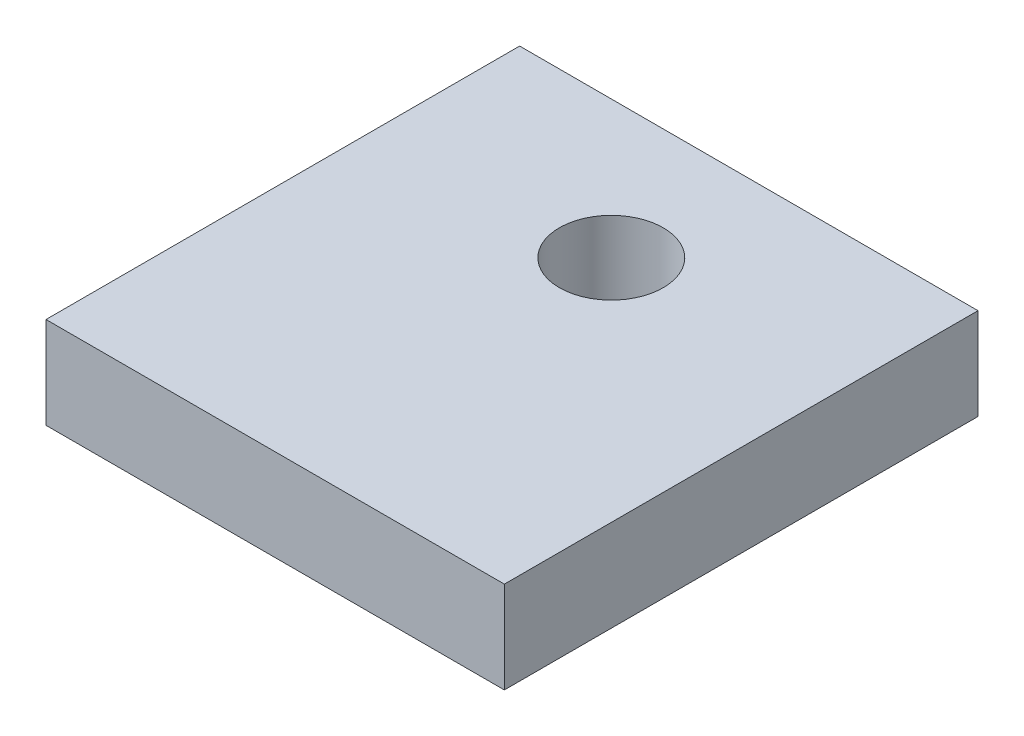
ISO-10303-21;
HEADER;
FILE_DESCRIPTION(('STEP AP214'),'2;1');
FILE_NAME('part.step','',(''),(''),'','','');
FILE_SCHEMA(('AUTOMOTIVE_DESIGN { 1 0 10303 214 1 1 1 1 }'));
ENDSEC;
DATA;
#1=APPLICATION_CONTEXT('core data for automotive mechanical design processes');
#2=APPLICATION_PROTOCOL_DEFINITION('international standard','automotive_design',2000,#1);
#3=PRODUCT_CONTEXT('',#1,'mechanical');
#4=PRODUCT('Part','Part','',(#3));
#5=PRODUCT_RELATED_PRODUCT_CATEGORY('part','',(#4));
#6=PRODUCT_DEFINITION_FORMATION('','',#4);
#7=PRODUCT_DEFINITION_CONTEXT('part definition',#1,'design');
#8=PRODUCT_DEFINITION('design','',#6,#7);
#9=PRODUCT_DEFINITION_SHAPE('','',#8);
#10=(LENGTH_UNIT() NAMED_UNIT(*) SI_UNIT(.MILLI.,.METRE.));
#11=(NAMED_UNIT(*) PLANE_ANGLE_UNIT() SI_UNIT($,.RADIAN.));
#12=(NAMED_UNIT(*) SI_UNIT($,.STERADIAN.) SOLID_ANGLE_UNIT());
#13=UNCERTAINTY_MEASURE_WITH_UNIT(LENGTH_MEASURE(1.E-05),#10,'distance_accuracy_value','');
#14=(GEOMETRIC_REPRESENTATION_CONTEXT(3) GLOBAL_UNCERTAINTY_ASSIGNED_CONTEXT((#13)) GLOBAL_UNIT_ASSIGNED_CONTEXT((#10,
#11,#12)) REPRESENTATION_CONTEXT('',''));
#15=CARTESIAN_POINT('',(0.,0.,0.));
#16=DIRECTION('',(0.,0.,1.));
#17=DIRECTION('',(1.,0.,0.));
#18=AXIS2_PLACEMENT_3D('',#15,#16,#17);
#19=CARTESIAN_POINT('',(0.,6.,0.));
#20=DIRECTION('',(0.,1.,0.));
#21=DIRECTION('',(0.,0.,1.));
#22=AXIS2_PLACEMENT_3D('',#19,#20,#21);
#23=PLANE('',#22);
#24=CARTESIAN_POINT('',(0.,6.,-6.5));
#25=DIRECTION('',(0.,1.,0.));
#26=DIRECTION('',(0.,0.,1.));
#27=AXIS2_PLACEMENT_3D('',#24,#25,#26);
#28=CIRCLE('',#27,3.4);
#29=CARTESIAN_POINT('',(0.,6.,-3.1));
#30=VERTEX_POINT('',#29);
#31=EDGE_CURVE('E20',#30,#30,#28,.F.);
#32=ORIENTED_EDGE('',*,*,#31,.T.);
#33=EDGE_LOOP('',(#32));
#34=FACE_BOUND('',#33,.T.);
#35=DIRECTION('',(-1.,0.,0.));
#36=VECTOR('',#35,1.);
#37=CARTESIAN_POINT('',(15.,6.,-15.5));
#38=LINE('',#37,#36);
#39=CARTESIAN_POINT('',(-15.,6.,-15.5));
#40=VERTEX_POINT('',#39);
#41=CARTESIAN_POINT('',(15.,6.,-15.5));
#42=VERTEX_POINT('',#41);
#43=EDGE_CURVE('E70',#40,#42,#38,.F.);
#44=ORIENTED_EDGE('',*,*,#43,.F.);
#45=DIRECTION('',(0.,0.,1.));
#46=VECTOR('',#45,1.);
#47=CARTESIAN_POINT('',(-15.,6.,-15.5));
#48=LINE('',#47,#46);
#49=CARTESIAN_POINT('',(-15.,6.,15.5));
#50=VERTEX_POINT('',#49);
#51=EDGE_CURVE('E67',#50,#40,#48,.F.);
#52=ORIENTED_EDGE('',*,*,#51,.F.);
#53=DIRECTION('',(1.,0.,0.));
#54=VECTOR('',#53,1.);
#55=CARTESIAN_POINT('',(-15.,6.,15.5));
#56=LINE('',#55,#54);
#57=CARTESIAN_POINT('',(15.,6.,15.5));
#58=VERTEX_POINT('',#57);
#59=EDGE_CURVE('E58',#58,#50,#56,.F.);
#60=ORIENTED_EDGE('',*,*,#59,.F.);
#61=DIRECTION('',(0.,0.,-1.));
#62=VECTOR('',#61,1.);
#63=CARTESIAN_POINT('',(15.,6.,15.5));
#64=LINE('',#63,#62);
#65=EDGE_CURVE('E53',#42,#58,#64,.F.);
#66=ORIENTED_EDGE('',*,*,#65,.F.);
#67=EDGE_LOOP('',(#44,#52,#60,#66));
#68=FACE_BOUND('',#67,.T.);
#69=ADVANCED_FACE('F17',(#34,#68),#23,.T.);
#70=CARTESIAN_POINT('',(-15.,0.,-15.5));
#71=DIRECTION('',(-1.,0.,0.));
#72=DIRECTION('',(0.,0.,1.));
#73=AXIS2_PLACEMENT_3D('',#70,#71,#72);
#74=PLANE('',#73);
#75=DIRECTION('',(0.,1.,0.));
#76=VECTOR('',#75,1.);
#77=CARTESIAN_POINT('',(-15.,0.,-15.5));
#78=LINE('',#77,#76);
#79=CARTESIAN_POINT('',(-15.,0.,-15.5));
#80=VERTEX_POINT('',#79);
#81=EDGE_CURVE('E82',#80,#40,#78,.T.);
#82=ORIENTED_EDGE('',*,*,#81,.F.);
#83=DIRECTION('',(0.,0.,1.));
#84=VECTOR('',#83,1.);
#85=CARTESIAN_POINT('',(-15.,0.,0.));
#86=LINE('',#85,#84);
#87=CARTESIAN_POINT('',(-15.,0.,15.5));
#88=VERTEX_POINT('',#87);
#89=EDGE_CURVE('E77',#80,#88,#86,.T.);
#90=ORIENTED_EDGE('',*,*,#89,.T.);
#91=DIRECTION('',(0.,1.,0.));
#92=VECTOR('',#91,1.);
#93=CARTESIAN_POINT('',(-15.,0.,15.5));
#94=LINE('',#93,#92);
#95=EDGE_CURVE('E63',#50,#88,#94,.F.);
#96=ORIENTED_EDGE('',*,*,#95,.F.);
#97=ORIENTED_EDGE('',*,*,#51,.T.);
#98=EDGE_LOOP('',(#82,#90,#96,#97));
#99=FACE_BOUND('',#98,.T.);
#100=ADVANCED_FACE('F76',(#99),#74,.T.);
#101=CARTESIAN_POINT('',(-15.,0.,15.5));
#102=DIRECTION('',(0.,0.,1.));
#103=DIRECTION('',(1.,0.,0.));
#104=AXIS2_PLACEMENT_3D('',#101,#102,#103);
#105=PLANE('',#104);
#106=ORIENTED_EDGE('',*,*,#95,.T.);
#107=DIRECTION('',(1.,0.,0.));
#108=VECTOR('',#107,1.);
#109=CARTESIAN_POINT('',(0.,0.,15.5));
#110=LINE('',#109,#108);
#111=CARTESIAN_POINT('',(15.,0.,15.5));
#112=VERTEX_POINT('',#111);
#113=EDGE_CURVE('E87',#88,#112,#110,.T.);
#114=ORIENTED_EDGE('',*,*,#113,.T.);
#115=DIRECTION('',(0.,1.,0.));
#116=VECTOR('',#115,1.);
#117=CARTESIAN_POINT('',(15.,0.,15.5));
#118=LINE('',#117,#116);
#119=EDGE_CURVE('E65',#58,#112,#118,.F.);
#120=ORIENTED_EDGE('',*,*,#119,.F.);
#121=ORIENTED_EDGE('',*,*,#59,.T.);
#122=EDGE_LOOP('',(#106,#114,#120,#121));
#123=FACE_BOUND('',#122,.T.);
#124=ADVANCED_FACE('F60',(#123),#105,.T.);
#125=CARTESIAN_POINT('',(15.,0.,15.5));
#126=DIRECTION('',(1.,0.,0.));
#127=DIRECTION('',(0.,0.,-1.));
#128=AXIS2_PLACEMENT_3D('',#125,#126,#127);
#129=PLANE('',#128);
#130=ORIENTED_EDGE('',*,*,#119,.T.);
#131=DIRECTION('',(0.,0.,1.));
#132=VECTOR('',#131,1.);
#133=CARTESIAN_POINT('',(15.,0.,0.));
#134=LINE('',#133,#132);
#135=CARTESIAN_POINT('',(15.,0.,-15.5));
#136=VERTEX_POINT('',#135);
#137=EDGE_CURVE('E89',#112,#136,#134,.F.);
#138=ORIENTED_EDGE('',*,*,#137,.T.);
#139=DIRECTION('',(0.,1.,0.));
#140=VECTOR('',#139,1.);
#141=CARTESIAN_POINT('',(15.,0.,-15.5));
#142=LINE('',#141,#140);
#143=EDGE_CURVE('E34',#42,#136,#142,.F.);
#144=ORIENTED_EDGE('',*,*,#143,.F.);
#145=ORIENTED_EDGE('',*,*,#65,.T.);
#146=EDGE_LOOP('',(#130,#138,#144,#145));
#147=FACE_BOUND('',#146,.T.);
#148=ADVANCED_FACE('F96',(#147),#129,.T.);
#149=CARTESIAN_POINT('',(15.,0.,-15.5));
#150=DIRECTION('',(0.,0.,-1.));
#151=DIRECTION('',(-1.,0.,0.));
#152=AXIS2_PLACEMENT_3D('',#149,#150,#151);
#153=PLANE('',#152);
#154=ORIENTED_EDGE('',*,*,#143,.T.);
#155=DIRECTION('',(1.,0.,0.));
#156=VECTOR('',#155,1.);
#157=CARTESIAN_POINT('',(0.,0.,-15.5));
#158=LINE('',#157,#156);
#159=EDGE_CURVE('E26',#136,#80,#158,.F.);
#160=ORIENTED_EDGE('',*,*,#159,.T.);
#161=ORIENTED_EDGE('',*,*,#81,.T.);
#162=ORIENTED_EDGE('',*,*,#43,.T.);
#163=EDGE_LOOP('',(#154,#160,#161,#162));
#164=FACE_BOUND('',#163,.T.);
#165=ADVANCED_FACE('F92',(#164),#153,.T.);
#166=CARTESIAN_POINT('',(0.,-3.49507240993,-6.5));
#167=DIRECTION('',(0.,1.,0.));
#168=DIRECTION('',(0.,0.,1.));
#169=AXIS2_PLACEMENT_3D('',#166,#167,#168);
#170=CYLINDRICAL_SURFACE('',#169,3.4);
#171=ORIENTED_EDGE('',*,*,#31,.F.);
#172=EDGE_LOOP('',(#171));
#173=FACE_BOUND('',#172,.T.);
#174=CARTESIAN_POINT('',(0.,0.,-6.5));
#175=DIRECTION('',(0.,1.,0.));
#176=DIRECTION('',(0.,0.,1.));
#177=AXIS2_PLACEMENT_3D('',#174,#175,#176);
#178=CIRCLE('',#177,3.4);
#179=CARTESIAN_POINT('',(0.,0.,-3.1));
#180=VERTEX_POINT('',#179);
#181=EDGE_CURVE('E11',#180,#180,#178,.F.);
#182=ORIENTED_EDGE('',*,*,#181,.T.);
#183=EDGE_LOOP('',(#182));
#184=FACE_BOUND('',#183,.T.);
#185=ADVANCED_FACE('F104',(#173,#184),#170,.F.);
#186=CARTESIAN_POINT('',(0.,0.,0.));
#187=DIRECTION('',(0.,1.,0.));
#188=DIRECTION('',(0.,0.,1.));
#189=AXIS2_PLACEMENT_3D('',#186,#187,#188);
#190=PLANE('',#189);
#191=ORIENTED_EDGE('',*,*,#181,.F.);
#192=EDGE_LOOP('',(#191));
#193=FACE_BOUND('',#192,.T.);
#194=ORIENTED_EDGE('',*,*,#137,.F.);
#195=ORIENTED_EDGE('',*,*,#113,.F.);
#196=ORIENTED_EDGE('',*,*,#89,.F.);
#197=ORIENTED_EDGE('',*,*,#159,.F.);
#198=EDGE_LOOP('',(#194,#195,#196,#197));
#199=FACE_BOUND('',#198,.T.);
#200=ADVANCED_FACE('F95',(#193,#199),#190,.F.);
#201=CLOSED_SHELL('',(#69,#100,#124,#148,#165,#185,#200));
#202=MANIFOLD_SOLID_BREP('B1',#201);
#203=ADVANCED_BREP_SHAPE_REPRESENTATION('',(#18,#202),#14);
#204=SHAPE_DEFINITION_REPRESENTATION(#9,#203);
ENDSEC;
END-ISO-10303-21;
